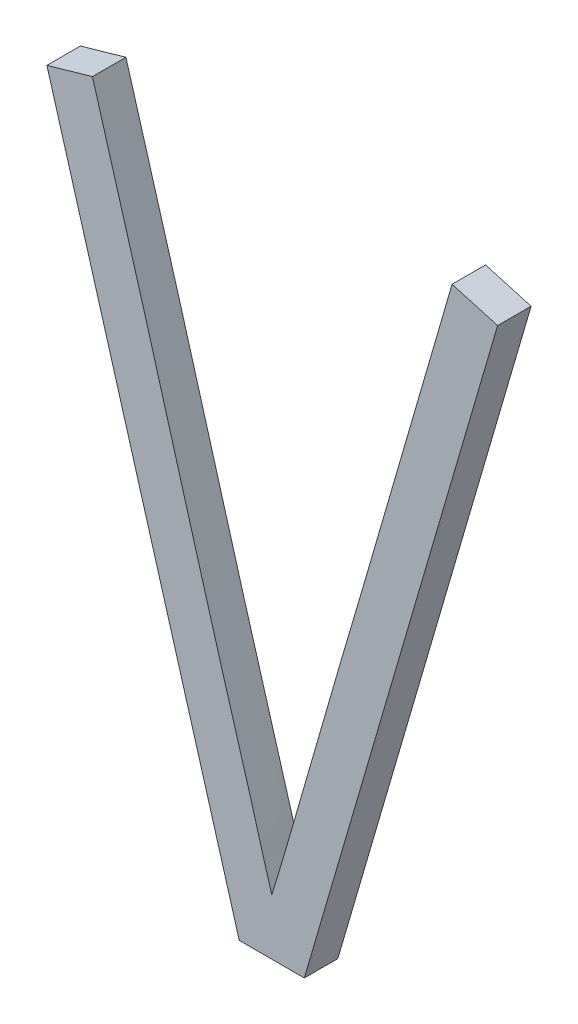
ISO-10303-21;
HEADER;
FILE_DESCRIPTION(('STEP AP214'),'2;1');
FILE_NAME('part.step','',(''),(''),'','','');
FILE_SCHEMA(('AUTOMOTIVE_DESIGN { 1 0 10303 214 1 1 1 1 }'));
ENDSEC;
DATA;
#1=APPLICATION_CONTEXT('core data for automotive mechanical design processes');
#2=APPLICATION_PROTOCOL_DEFINITION('international standard','automotive_design',2000,#1);
#3=PRODUCT_CONTEXT('',#1,'mechanical');
#4=PRODUCT('Part','Part','',(#3));
#5=PRODUCT_RELATED_PRODUCT_CATEGORY('part','',(#4));
#6=PRODUCT_DEFINITION_FORMATION('','',#4);
#7=PRODUCT_DEFINITION_CONTEXT('part definition',#1,'design');
#8=PRODUCT_DEFINITION('design','',#6,#7);
#9=PRODUCT_DEFINITION_SHAPE('','',#8);
#10=(LENGTH_UNIT() NAMED_UNIT(*) SI_UNIT(.MILLI.,.METRE.));
#11=(NAMED_UNIT(*) PLANE_ANGLE_UNIT() SI_UNIT($,.RADIAN.));
#12=(NAMED_UNIT(*) SI_UNIT($,.STERADIAN.) SOLID_ANGLE_UNIT());
#13=UNCERTAINTY_MEASURE_WITH_UNIT(LENGTH_MEASURE(1.E-05),#10,'distance_accuracy_value','');
#14=(GEOMETRIC_REPRESENTATION_CONTEXT(3) GLOBAL_UNCERTAINTY_ASSIGNED_CONTEXT((#13)) GLOBAL_UNIT_ASSIGNED_CONTEXT((#10,
#11,#12)) REPRESENTATION_CONTEXT('',''));
#15=CARTESIAN_POINT('',(0.,0.,0.));
#16=DIRECTION('',(0.,0.,1.));
#17=DIRECTION('',(1.,0.,0.));
#18=AXIS2_PLACEMENT_3D('',#15,#16,#17);
#19=CARTESIAN_POINT('',(148.165393177078,66.869071623967,-39.1));
#20=DIRECTION('',(0.,0.,1.));
#21=DIRECTION('',(1.,0.,0.));
#22=AXIS2_PLACEMENT_3D('',#19,#20,#21);
#23=PLANE('',#22);
#24=CARTESIAN_POINT('',(147.36008712506,67.7930468476711,-39.1));
#25=CARTESIAN_POINT('',(147.36950715995,67.761072172586,-39.1));
#26=CARTESIAN_POINT('',(147.378916668758,67.7290943956638,-39.1));
#27=CARTESIAN_POINT('',(147.397710961665,67.6651317332712,-39.1));
#28=CARTESIAN_POINT('',(147.407095745876,67.6331468478334,-39.1));
#29=CARTESIAN_POINT('',(147.435207865122,67.5371789367533,-39.1));
#30=CARTESIAN_POINT('',(147.453892729733,67.4731834602558,-39.1));
#31=CARTESIAN_POINT('',(147.491121981187,67.3451517856524,-39.1));
#32=CARTESIAN_POINT('',(147.509666368339,67.2811155876367,-39.1));
#33=CARTESIAN_POINT('',(147.546581864893,67.1529927307791,-39.1));
#34=CARTESIAN_POINT('',(147.564952972988,67.0889060715606,-39.1));
#35=CARTESIAN_POINT('',(147.592399605312,66.9927446724667,-39.1));
#36=CARTESIAN_POINT('',(147.601530151106,66.9606856142019,-39.1));
#37=CARTESIAN_POINT('',(147.619754626931,66.8965570683165,-39.1));
#38=CARTESIAN_POINT('',(147.628848556952,66.8644875806933,-39.1));
#39=CARTESIAN_POINT('',(147.659015193138,66.758406287851,-39.1));
#40=CARTESIAN_POINT('',(147.680191055627,66.6844239247388,-39.1));
#41=CARTESIAN_POINT('',(147.722781483505,66.5365268936578,-39.1));
#42=CARTESIAN_POINT('',(147.744196049204,66.4626122257771,-39.1));
#43=CARTESIAN_POINT('',(147.776885285108,66.3519075672974,-39.1));
#44=CARTESIAN_POINT('',(147.787876299194,66.3150337824738,-39.1));
#45=CARTESIAN_POINT('',(147.809814393848,66.2412729536008,-39.1));
#46=CARTESIAN_POINT('',(147.820761474547,66.2043859095913,-39.1));
#47=CARTESIAN_POINT('',(147.836872499413,66.1489652269203,-39.1));
#48=CARTESIAN_POINT('',(147.84219120302,66.1304767853057,-39.1));
#49=CARTESIAN_POINT('',(147.852731059657,66.0934719922423,-39.1));
#50=CARTESIAN_POINT('',(147.857952211651,66.0749556404994,-39.1));
#51=CARTESIAN_POINT('',(147.868368330914,66.0379148121562,-39.1));
#52=CARTESIAN_POINT('',(147.873563297038,66.0193903352382,-39.1));
#53=CARTESIAN_POINT('',(147.881512001052,65.9916474341452,-39.1));
#54=CARTESIAN_POINT('',(147.884187613388,65.9824070966032,-39.1));
#55=CARTESIAN_POINT('',(147.889686554057,65.9639697601432,-39.1));
#56=CARTESIAN_POINT('',(147.892509897015,65.9547727656149,-39.1));
#57=CARTESIAN_POINT('',(147.89545467013,65.9456127283911,-39.1));
#58=B_SPLINE_CURVE_WITH_KNOTS('',3,(#24,#25,#26,#27,#28,#29,#30,#31,#32,#33,#34,#35,#36,#37,#38,
#39,#40,#41,#42,#43,#44,#45,#46,#47,#48,#49,#50,#51,#52,#53,#54,#55,#56,#57),.UNSPECIFIED.,.F.,
.F.,(4,2,2,2,2,2,2,2,2,2,2,2,2,2,2,2,4),(0.,0.100000258752922,0.200000068886179,
0.400002203536709,0.600003896466351,0.800007096147163,0.9000088426627,1.00001061385149,
1.23087060455843,1.4617308950943,1.57716180940412,1.69259238034469,1.75030680186558,
1.80802183595669,1.86573937467342,1.89459818300726,1.92345985386881),.UNSPECIFIED.);
#59=CARTESIAN_POINT('',(147.360087125061,67.7930468476698,-39.1));
#60=VERTEX_POINT('',#59);
#61=CARTESIAN_POINT('',(147.89545467013,65.9456127283911,-39.1));
#62=VERTEX_POINT('',#61);
#63=EDGE_CURVE('E105',#60,#62,#58,.T.);
#64=ORIENTED_EDGE('',*,*,#63,.T.);
#65=CARTESIAN_POINT('',(147.89545467013,65.9456127283911,-39.1));
#66=CARTESIAN_POINT('',(147.898031632222,65.9535412531738,-39.1));
#67=CARTESIAN_POINT('',(147.900539160209,65.9614915705498,-39.1));
#68=CARTESIAN_POINT('',(147.90546738492,65.9774187894192,-39.1));
#69=CARTESIAN_POINT('',(147.907888085495,65.9853956897167,-39.1));
#70=CARTESIAN_POINT('',(147.915098226982,66.009341499801,-39.1));
#71=CARTESIAN_POINT('',(147.919835808545,66.0253258436347,-39.1));
#72=CARTESIAN_POINT('',(147.92928250306,66.0573026658751,-39.1));
#73=CARTESIAN_POINT('',(147.933991616436,66.0732951441568,-39.1));
#74=CARTESIAN_POINT('',(147.943376159649,66.1052901407925,-39.1));
#75=CARTESIAN_POINT('',(147.94805158918,66.1212926592364,-39.1));
#76=CARTESIAN_POINT('',(147.971377874188,66.2012996334036,-39.1));
#77=CARTESIAN_POINT('',(147.989892689447,66.2653436745062,-39.1));
#78=CARTESIAN_POINT('',(148.026871700727,66.3934458580657,-39.1));
#79=CARTESIAN_POINT('',(148.045335897017,66.457504000445,-39.1));
#80=CARTESIAN_POINT('',(148.073022500083,66.5535948814044,-39.1));
#81=CARTESIAN_POINT('',(148.082249860325,66.5856261606545,-39.1));
#82=CARTESIAN_POINT('',(148.100776795741,66.6496675874551,-39.1));
#83=CARTESIAN_POINT('',(148.110076370409,66.6816777351523,-39.1));
#84=CARTESIAN_POINT('',(148.128772604368,66.7456700198175,-39.1));
#85=CARTESIAN_POINT('',(148.138169264263,66.7776521566104,-39.1));
#86=CARTESIAN_POINT('',(148.157153724879,66.8415597349228,-39.1));
#87=CARTESIAN_POINT('',(148.166741526334,66.8734851762243,-39.1));
#88=CARTESIAN_POINT('',(148.187210694472,66.9423487258354,-39.1));
#89=CARTESIAN_POINT('',(148.198061883241,66.9792958180128,-39.1));
#90=CARTESIAN_POINT('',(148.219582328465,67.0532428165823,-39.1));
#91=CARTESIAN_POINT('',(148.230251584399,67.0902427231256,-39.1));
#92=CARTESIAN_POINT('',(148.251580488372,67.1642451972022,-39.1));
#93=CARTESIAN_POINT('',(148.26224013643,67.2012477647304,-39.1));
#94=CARTESIAN_POINT('',(148.283618572783,67.2752357572871,-39.1));
#95=CARTESIAN_POINT('',(148.294337360979,67.3122211823444,-39.1));
#96=CARTESIAN_POINT('',(148.32652498377,67.4231668972974,-39.1));
#97=CARTESIAN_POINT('',(148.348025471817,67.4971179951606,-39.1));
#98=CARTESIAN_POINT('',(148.390929167613,67.6450482063845,-39.1));
#99=CARTESIAN_POINT('',(148.41233237555,67.7190273196909,-39.1));
#100=CARTESIAN_POINT('',(148.43359614031,67.7930468476711,-39.1));
#101=B_SPLINE_CURVE_WITH_KNOTS('',3,(#65,#66,#67,#68,#69,#70,#71,#72,#73,#74,#75,#76,#77,#78,
#79,#80,#81,#82,#83,#84,#85,#86,#87,#88,#89,#90,#91,#92,#93,#94,#95,#96,#97,#98,#99,#100),
.UNSPECIFIED.,.F.,.F.,(4,2,2,2,2,2,2,2,2,2,2,2,2,2,2,2,2,4),(0.,0.0250090613853834,
0.0500170125768512,0.100031894549799,0.150046029711649,0.200060619703676,0.400060164416404,
0.600058635157055,0.700060207955259,0.800061078536629,0.900062569507321,1.00006444396406,
1.11558645965158,1.23110880665364,1.34663094168454,1.46215288172401,1.69319248941036,
1.9242316498274),.UNSPECIFIED.);
#102=CARTESIAN_POINT('',(148.43359614031,67.7930468476711,-39.1));
#103=VERTEX_POINT('',#102);
#104=EDGE_CURVE('E24',#62,#103,#101,.T.);
#105=ORIENTED_EDGE('',*,*,#104,.T.);
#106=DIRECTION('',(0.96152394764082,-0.274721127897389,0.));
#107=VECTOR('',#106,1.);
#108=CARTESIAN_POINT('',(148.569518470411,67.7542118962138,-39.1));
#109=LINE('',#108,#107);
#110=CARTESIAN_POINT('',(148.569518470411,67.7542118962129,-39.1));
#111=VERTEX_POINT('',#110);
#112=EDGE_CURVE('E63',#103,#111,#109,.T.);
#113=ORIENTED_EDGE('',*,*,#112,.T.);
#114=DIRECTION('',(-0.2804141240353,-0.959879116889994,0.));
#115=VECTOR('',#114,1.);
#116=CARTESIAN_POINT('',(147.992542048775,65.7791772221526,-39.1));
#117=LINE('',#116,#115);
#118=CARTESIAN_POINT('',(147.992542048775,65.7791772221512,-39.1));
#119=VERTEX_POINT('',#118);
#120=EDGE_CURVE('E71',#111,#119,#117,.T.);
#121=ORIENTED_EDGE('',*,*,#120,.T.);
#122=DIRECTION('',(1.,0.,0.));
#123=VECTOR('',#122,1.);
#124=CARTESIAN_POINT('',(147.79836729149,65.7791772221511,-39.1));
#125=LINE('',#124,#123);
#126=CARTESIAN_POINT('',(147.79836729149,65.7791772221511,-39.1));
#127=VERTEX_POINT('',#126);
#128=EDGE_CURVE('E180',#119,#127,#125,.F.);
#129=ORIENTED_EDGE('',*,*,#128,.T.);
#130=DIRECTION('',(-0.279171282963393,0.960241321110779,0.));
#131=VECTOR('',#130,1.);
#132=CARTESIAN_POINT('',(147.224164794959,67.7542118962107,-39.1));
#133=LINE('',#132,#131);
#134=CARTESIAN_POINT('',(147.224164794959,67.7542118962108,-39.1));
#135=VERTEX_POINT('',#134);
#136=EDGE_CURVE('E189',#127,#135,#133,.T.);
#137=ORIENTED_EDGE('',*,*,#136,.T.);
#138=DIRECTION('',(0.96152394764082,0.274721127897389,0.));
#139=VECTOR('',#138,1.);
#140=CARTESIAN_POINT('',(147.360087125061,67.7930468476685,-39.1));
#141=LINE('',#140,#139);
#142=EDGE_CURVE('E163',#135,#60,#141,.T.);
#143=ORIENTED_EDGE('',*,*,#142,.T.);
#144=EDGE_LOOP('',(#64,#105,#113,#121,#129,#137,#143));
#145=FACE_BOUND('',#144,.T.);
#146=ADVANCED_FACE('F17',(#145),#23,.F.);
#147=CARTESIAN_POINT('',(147.360087125061,67.7930468476685,-39.));
#148=DIRECTION('',(0.274721127897389,-0.96152394764082,0.));
#149=DIRECTION('',(0.96152394764082,0.274721127897389,0.));
#150=AXIS2_PLACEMENT_3D('',#147,#148,#149);
#151=PLANE('',#150);
#152=DIRECTION('',(0.,0.,1.));
#153=VECTOR('',#152,1.);
#154=CARTESIAN_POINT('',(147.224164794959,67.7542118962107,-39.));
#155=LINE('',#154,#153);
#156=CARTESIAN_POINT('',(147.22416479496,67.754211896211,-39.));
#157=VERTEX_POINT('',#156);
#158=EDGE_CURVE('E100',#135,#157,#155,.T.);
#159=ORIENTED_EDGE('',*,*,#158,.T.);
#160=DIRECTION('',(-0.961523947640779,-0.274721127897534,0.));
#161=VECTOR('',#160,1.);
#162=CARTESIAN_POINT('',(147.360087125061,67.7930468476685,-39.));
#163=LINE('',#162,#161);
#164=CARTESIAN_POINT('',(147.360087125061,67.7930468476698,-39.));
#165=VERTEX_POINT('',#164);
#166=EDGE_CURVE('E94',#165,#157,#163,.T.);
#167=ORIENTED_EDGE('',*,*,#166,.F.);
#168=DIRECTION('',(0.,0.,-1.));
#169=VECTOR('',#168,1.);
#170=CARTESIAN_POINT('',(147.36008712506,67.7930468476711,-39.05));
#171=LINE('',#170,#169);
#172=EDGE_CURVE('E97',#165,#60,#171,.T.);
#173=ORIENTED_EDGE('',*,*,#172,.T.);
#174=ORIENTED_EDGE('',*,*,#142,.F.);
#175=EDGE_LOOP('',(#159,#167,#173,#174));
#176=FACE_BOUND('',#175,.T.);
#177=ADVANCED_FACE('F96',(#176),#151,.F.);
#178=CARTESIAN_POINT('',(147.224164794959,67.7542118962107,-39.));
#179=DIRECTION('',(0.960241321110779,0.279171282963393,0.));
#180=DIRECTION('',(-0.279171282963393,0.960241321110779,0.));
#181=AXIS2_PLACEMENT_3D('',#178,#179,#180);
#182=PLANE('',#181);
#183=DIRECTION('',(0.,0.,1.));
#184=VECTOR('',#183,1.);
#185=CARTESIAN_POINT('',(147.79836729149,65.7791772221511,-39.));
#186=LINE('',#185,#184);
#187=CARTESIAN_POINT('',(147.79836729149,65.7791772221511,-39.));
#188=VERTEX_POINT('',#187);
#189=EDGE_CURVE('E187',#127,#188,#186,.T.);
#190=ORIENTED_EDGE('',*,*,#189,.T.);
#191=DIRECTION('',(0.279171282962724,-0.960241321110973,0.));
#192=VECTOR('',#191,1.);
#193=CARTESIAN_POINT('',(147.22416479496,67.7542118962111,-39.));
#194=LINE('',#193,#192);
#195=EDGE_CURVE('E104',#157,#188,#194,.T.);
#196=ORIENTED_EDGE('',*,*,#195,.F.);
#197=ORIENTED_EDGE('',*,*,#158,.F.);
#198=ORIENTED_EDGE('',*,*,#136,.F.);
#199=EDGE_LOOP('',(#190,#196,#197,#198));
#200=FACE_BOUND('',#199,.T.);
#201=ADVANCED_FACE('F149',(#200),#182,.F.);
#202=CARTESIAN_POINT('',(147.79836729149,65.7791772221511,-39.));
#203=DIRECTION('',(0.,1.,0.));
#204=DIRECTION('',(0.,0.,1.));
#205=AXIS2_PLACEMENT_3D('',#202,#203,#204);
#206=PLANE('',#205);
#207=DIRECTION('',(0.,0.,1.));
#208=VECTOR('',#207,1.);
#209=CARTESIAN_POINT('',(147.992542048775,65.7791772221512,-39.));
#210=LINE('',#209,#208);
#211=CARTESIAN_POINT('',(147.992542048775,65.7791772221511,-39.));
#212=VERTEX_POINT('',#211);
#213=EDGE_CURVE('E178',#119,#212,#210,.T.);
#214=ORIENTED_EDGE('',*,*,#213,.T.);
#215=DIRECTION('',(1.,0.,0.));
#216=VECTOR('',#215,1.);
#217=CARTESIAN_POINT('',(148.165393177078,65.7791772221511,-39.));
#218=LINE('',#217,#216);
#219=EDGE_CURVE('E175',#188,#212,#218,.T.);
#220=ORIENTED_EDGE('',*,*,#219,.F.);
#221=ORIENTED_EDGE('',*,*,#189,.F.);
#222=ORIENTED_EDGE('',*,*,#128,.F.);
#223=EDGE_LOOP('',(#214,#220,#221,#222));
#224=FACE_BOUND('',#223,.T.);
#225=ADVANCED_FACE('F146',(#224),#206,.F.);
#226=CARTESIAN_POINT('',(147.992542048775,65.7791772221526,-39.));
#227=DIRECTION('',(-0.959879116889994,0.2804141240353,0.));
#228=DIRECTION('',(-0.2804141240353,-0.959879116889994,0.));
#229=AXIS2_PLACEMENT_3D('',#226,#227,#228);
#230=PLANE('',#229);
#231=DIRECTION('',(0.,0.,1.));
#232=VECTOR('',#231,1.);
#233=CARTESIAN_POINT('',(148.569518470411,67.7542118962138,-39.));
#234=LINE('',#233,#232);
#235=CARTESIAN_POINT('',(148.569518470411,67.754211896212,-39.));
#236=VERTEX_POINT('',#235);
#237=EDGE_CURVE('E170',#111,#236,#234,.T.);
#238=ORIENTED_EDGE('',*,*,#237,.T.);
#239=DIRECTION('',(0.280414124035111,0.95987911689005,0.));
#240=VECTOR('',#239,1.);
#241=CARTESIAN_POINT('',(147.992542048775,65.7791772221511,-39.));
#242=LINE('',#241,#240);
#243=EDGE_CURVE('E116',#212,#236,#242,.T.);
#244=ORIENTED_EDGE('',*,*,#243,.F.);
#245=ORIENTED_EDGE('',*,*,#213,.F.);
#246=ORIENTED_EDGE('',*,*,#120,.F.);
#247=EDGE_LOOP('',(#238,#244,#245,#246));
#248=FACE_BOUND('',#247,.T.);
#249=ADVANCED_FACE('F143',(#248),#230,.F.);
#250=CARTESIAN_POINT('',(148.569518470411,67.7542118962138,-39.));
#251=DIRECTION('',(-0.274721127897389,-0.96152394764082,0.));
#252=DIRECTION('',(0.96152394764082,-0.274721127897389,0.));
#253=AXIS2_PLACEMENT_3D('',#250,#251,#252);
#254=PLANE('',#253);
#255=DIRECTION('',(0.,0.,1.));
#256=VECTOR('',#255,1.);
#257=CARTESIAN_POINT('',(148.43359614031,67.7930468476711,-39.05));
#258=LINE('',#257,#256);
#259=CARTESIAN_POINT('',(148.43359614031,67.7930468476711,-39.));
#260=VERTEX_POINT('',#259);
#261=EDGE_CURVE('E165',#103,#260,#258,.T.);
#262=ORIENTED_EDGE('',*,*,#261,.T.);
#263=DIRECTION('',(-0.9615239476355,0.27472112791601,0.));
#264=VECTOR('',#263,1.);
#265=CARTESIAN_POINT('',(148.56951847041,67.7542118962111,-39.));
#266=LINE('',#265,#264);
#267=EDGE_CURVE('E114',#236,#260,#266,.T.);
#268=ORIENTED_EDGE('',*,*,#267,.F.);
#269=ORIENTED_EDGE('',*,*,#237,.F.);
#270=ORIENTED_EDGE('',*,*,#112,.F.);
#271=EDGE_LOOP('',(#262,#268,#269,#270));
#272=FACE_BOUND('',#271,.T.);
#273=ADVANCED_FACE('F139',(#272),#254,.F.);
#274=CARTESIAN_POINT('',(148.43359614031,67.7930468476711,-39.));
#275=CARTESIAN_POINT('',(148.43359614031,67.7930468476711,-39.1));
#276=CARTESIAN_POINT('',(148.4038930415,67.6896355089511,-39.));
#277=CARTESIAN_POINT('',(148.4038930415,67.6896355089511,-39.1));
#278=CARTESIAN_POINT('',(148.34583061401,67.4895370524111,-39.));
#279=CARTESIAN_POINT('',(148.34583061401,67.4895370524111,-39.1));
#280=CARTESIAN_POINT('',(148.26147591395,67.1992621120111,-39.));
#281=CARTESIAN_POINT('',(148.26147591395,67.1992621120111,-39.1));
#282=CARTESIAN_POINT('',(148.19727113691,66.9750912561411,-39.));
#283=CARTESIAN_POINT('',(148.19727113691,66.9750912561411,-39.1));
#284=CARTESIAN_POINT('',(148.14814364913,66.8116656650511,-39.));
#285=CARTESIAN_POINT('',(148.14814364913,66.8116656650511,-39.1));
#286=CARTESIAN_POINT('',(148.11583739353,66.7016157657711,-39.));
#287=CARTESIAN_POINT('',(148.11583739353,66.7016157657711,-39.1));
#288=CARTESIAN_POINT('',(148.08439177939,66.5931478737911,-39.));
#289=CARTESIAN_POINT('',(148.08439177939,66.5931478737911,-39.1));
#290=CARTESIAN_POINT('',(148.05420244207,66.4882182213711,-39.));
#291=CARTESIAN_POINT('',(148.05420244207,66.4882182213711,-39.1));
#292=CARTESIAN_POINT('',(148.02552481961,66.3888231947411,-39.));
#293=CARTESIAN_POINT('',(148.02552481961,66.3888231947411,-39.1));
#294=CARTESIAN_POINT('',(147.99883983501,66.2962998994112,-39.));
#295=CARTESIAN_POINT('',(147.99883983501,66.2962998994112,-39.1));
#296=CARTESIAN_POINT('',(147.97431535255,66.2114809751311,-39.));
#297=CARTESIAN_POINT('',(147.97431535255,66.2114809751311,-39.1));
#298=CARTESIAN_POINT('',(147.95212542838,66.1351975695711,-39.));
#299=CARTESIAN_POINT('',(147.95212542838,66.1351975695711,-39.1));
#300=CARTESIAN_POINT('',(147.93273583628,66.0689230239111,-39.));
#301=CARTESIAN_POINT('',(147.93273583628,66.0689230239111,-39.1));
#302=CARTESIAN_POINT('',(147.91673024826,66.0148251990111,-39.));
#303=CARTESIAN_POINT('',(147.91673024826,66.0148251990111,-39.1));
#304=CARTESIAN_POINT('',(147.90480884988,65.9750334008911,-39.));
#305=CARTESIAN_POINT('',(147.90480884988,65.9750334008911,-39.1));
#306=CARTESIAN_POINT('',(147.89808324439,65.9537103197911,-39.));
#307=CARTESIAN_POINT('',(147.89808324439,65.9537103197911,-39.1));
#308=CARTESIAN_POINT('',(147.89545467013,65.9456127283911,-39.));
#309=CARTESIAN_POINT('',(147.89545467013,65.9456127283911,-39.1));
#310=B_SPLINE_SURFACE_WITH_KNOTS('',3,1,((#274,#275),(#276,#277),(#278,#279),(#280,#281),(#282,
#283),(#284,#285),(#286,#287),(#288,#289),(#290,#291),(#292,#293),(#294,#295),(#296,#297),(#298,
#299),(#300,#301),(#302,#303),(#304,#305),(#306,#307),(#308,#309)),.UNSPECIFIED.,.F.,.F.,.F.,(4,
1,1,1,1,1,1,1,1,1,1,1,1,1,1,4),(2,2),(0.,0.1677421935607,0.32483576468,0.4712807587735,
0.531283389647,0.5908879033489,0.6500950895056,0.7073547788952,0.7611162009851,0.8113793571536,
0.8574842677003,0.8987710140583,0.93523970682659,0.96514144411123,0.98672767738162,1.),(1.,1.1),.UNSPECIFIED.);
#311=DIRECTION('',(0.,0.,1.));
#312=VECTOR('',#311,1.);
#313=CARTESIAN_POINT('',(147.89545467013,65.9456127283911,-39.05));
#314=LINE('',#313,#312);
#315=CARTESIAN_POINT('',(147.89545467013,65.9456127283911,-39.));
#316=VERTEX_POINT('',#315);
#317=EDGE_CURVE('E44',#62,#316,#314,.T.);
#318=CARTESIAN_POINT('',(148.43359614031,67.7930468476711,-39.));
#319=CARTESIAN_POINT('',(148.424393964571,67.7610088230179,-39.));
#320=CARTESIAN_POINT('',(148.415164629245,67.7289786209528,-39.));
#321=CARTESIAN_POINT('',(148.396667567213,67.6649293199262,-39.));
#322=CARTESIAN_POINT('',(148.387399840529,67.6329102209584,-39.));
#323=CARTESIAN_POINT('',(148.359562948743,67.5368627088916,-39.));
#324=CARTESIAN_POINT('',(148.340960072815,67.4728440837701,-39.));
#325=CARTESIAN_POINT('',(148.303779289452,67.3447995838746,-39.));
#326=CARTESIAN_POINT('',(148.285201382,67.2807737091057,-39.));
#327=CARTESIAN_POINT('',(148.257467227065,67.1846962176775,-39.));
#328=CARTESIAN_POINT('',(148.248244581283,67.1526637825132,-39.));
#329=CARTESIAN_POINT('',(148.229778050124,67.0886052998505,-39.));
#330=CARTESIAN_POINT('',(148.220534164896,67.0565792523093,-39.));
#331=CARTESIAN_POINT('',(148.201936240943,66.9925588198722,-39.));
#332=CARTESIAN_POINT('',(148.192582201932,66.9605644350589,-39.));
#333=CARTESIAN_POINT('',(148.173647660422,66.8966426037005,-39.));
#334=CARTESIAN_POINT('',(148.164067156235,66.8647151576563,-39.));
#335=CARTESIAN_POINT('',(148.143565026042,66.7958594885809,-39.));
#336=CARTESIAN_POINT('',(148.132666129212,66.7589244992705,-39.));
#337=CARTESIAN_POINT('',(148.11103055445,66.6850072194182,-39.));
#338=CARTESIAN_POINT('',(148.100293876096,66.6480249289997,-39.));
#339=CARTESIAN_POINT('',(148.07890487242,66.5740361379494,-39.));
#340=CARTESIAN_POINT('',(148.068252546898,66.5370296373755,-39.));
#341=CARTESIAN_POINT('',(148.046927623873,66.4630223606264,-39.));
#342=CARTESIAN_POINT('',(148.036255026312,66.426021584468,-39.));
#343=CARTESIAN_POINT('',(148.014911886828,66.3520193388708,-39.));
#344=CARTESIAN_POINT('',(148.004241344909,66.3150178694305,-39.));
#345=CARTESIAN_POINT('',(147.982857932453,66.241027360322,-39.));
#346=CARTESIAN_POINT('',(147.972145062153,66.2040383205851,-39.));
#347=CARTESIAN_POINT('',(147.956010529875,66.1485734861006,-39.));
#348=CARTESIAN_POINT('',(147.950621447533,66.1300882136878,-39.));
#349=CARTESIAN_POINT('',(147.939812073912,66.0931269192408,-39.));
#350=CARTESIAN_POINT('',(147.934391782864,66.074650897139,-39.));
#351=CARTESIAN_POINT('',(147.923507162709,66.0377113707886,-39.));
#352=CARTESIAN_POINT('',(147.918042832471,66.0192478668745,-39.));
#353=CARTESIAN_POINT('',(147.909755349545,65.9915791797539,-39.));
#354=CARTESIAN_POINT('',(147.906977656137,65.982360599671,-39.));
#355=CARTESIAN_POINT('',(147.901315403613,65.9639560743527,-39.));
#356=CARTESIAN_POINT('',(147.898430840201,65.954770130445,-39.));
#357=CARTESIAN_POINT('',(147.89545467013,65.9456127283911,-39.));
#358=B_SPLINE_CURVE_WITH_KNOTS('',3,(#318,#319,#320,#321,#322,#323,#324,#325,#326,#327,#328,
#329,#330,#331,#332,#333,#334,#335,#336,#337,#338,#339,#340,#341,#342,#343,#344,#345,#346,#347,
#348,#349,#350,#351,#352,#353,#354,#355,#356,#357),.UNSPECIFIED.,.F.,.F.,(4,2,2,2,2,2,2,2,2,2,2,
2,2,2,2,2,2,2,2,4),(0.,0.100000138213088,0.200000220674667,0.400000395404615,0.600000430920207,
0.700001435486516,0.800001744795815,0.900002314279683,1.00000362944108,1.11553159561296,
1.23105926100341,1.34658665066559,1.46211437447288,1.57764239706483,1.69316977002787,
1.75093417625746,1.80869815457101,1.86646362065275,1.89534705969222,1.92423166053322),.UNSPECIFIED.);
#359=EDGE_CURVE('E35',#260,#316,#358,.T.);
#360=ORIENTED_EDGE('',*,*,#317,.T.);
#361=ORIENTED_EDGE('',*,*,#359,.F.);
#362=ORIENTED_EDGE('',*,*,#261,.F.);
#363=ORIENTED_EDGE('',*,*,#104,.F.);
#364=EDGE_LOOP('',(#360,#361,#362,#363));
#365=FACE_BOUND('',#364,.T.);
#366=ADVANCED_FACE('F132',(#365),#310,.F.);
#367=CARTESIAN_POINT('',(147.89545467013,65.9456127283911,-39.));
#368=CARTESIAN_POINT('',(147.89545467013,65.9456127283911,-39.1));
#369=CARTESIAN_POINT('',(147.89285637025,65.9537043860611,-39.));
#370=CARTESIAN_POINT('',(147.89285637025,65.9537043860611,-39.1));
#371=CARTESIAN_POINT('',(147.886277019,65.9750111674711,-39.));
#372=CARTESIAN_POINT('',(147.886277019,65.9750111674711,-39.1));
#373=CARTESIAN_POINT('',(147.87484559006,66.0148120197811,-39.));
#374=CARTESIAN_POINT('',(147.87484559006,66.0148120197811,-39.1));
#375=CARTESIAN_POINT('',(147.85965769384,66.0689658967111,-39.));
#376=CARTESIAN_POINT('',(147.85965769384,66.0689658967111,-39.1));
#377=CARTESIAN_POINT('',(147.84089840136,66.1352887670811,-39.));
#378=CARTESIAN_POINT('',(147.84089840136,66.1352887670811,-39.1));
#379=CARTESIAN_POINT('',(147.81866722516,66.2115618406011,-39.));
#380=CARTESIAN_POINT('',(147.81866722516,66.2115618406011,-39.1));
#381=CARTESIAN_POINT('',(147.7934413267,66.2963103936311,-39.));
#382=CARTESIAN_POINT('',(147.7934413267,66.2963103936311,-39.1));
#383=CARTESIAN_POINT('',(147.76592097754,66.3887692349011,-39.));
#384=CARTESIAN_POINT('',(147.76592097754,66.3887692349011,-39.1));
#385=CARTESIAN_POINT('',(147.73682596132,66.4881780886111,-39.));
#386=CARTESIAN_POINT('',(147.73682596132,66.4881780886111,-39.1));
#387=CARTESIAN_POINT('',(147.70645385933,66.5930850082811,-39.));
#388=CARTESIAN_POINT('',(147.70645385933,66.5930850082811,-39.1));
#389=CARTESIAN_POINT('',(147.67531515553,66.7015372558611,-39.));
#390=CARTESIAN_POINT('',(147.67531515553,66.7015372558611,-39.1));
#391=CARTESIAN_POINT('',(147.64385709966,66.8115639925111,-39.));
#392=CARTESIAN_POINT('',(147.64385709966,66.8115639925111,-39.1));
#393=CARTESIAN_POINT('',(147.59740492883,66.9754119052911,-39.));
#394=CARTESIAN_POINT('',(147.59740492883,66.9754119052911,-39.1));
#395=CARTESIAN_POINT('',(147.53341682312,67.1993723866311,-39.));
#396=CARTESIAN_POINT('',(147.53341682312,67.1993723866311,-39.1));
#397=CARTESIAN_POINT('',(147.4492249163,67.4896973459611,-39.));
#398=CARTESIAN_POINT('',(147.4492249163,67.4896973459611,-39.1));
#399=CARTESIAN_POINT('',(147.3905250343,67.6897309587111,-39.));
#400=CARTESIAN_POINT('',(147.3905250343,67.6897309587111,-39.1));
#401=CARTESIAN_POINT('',(147.36008712506,67.7930468476711,-39.));
#402=CARTESIAN_POINT('',(147.36008712506,67.7930468476711,-39.1));
#403=B_SPLINE_SURFACE_WITH_KNOTS('',3,1,((#367,#368),(#369,#370),(#371,#372),(#373,#374),(#375,
#376),(#377,#378),(#379,#380),(#381,#382),(#383,#384),(#385,#386),(#387,#388),(#389,#390),(#391,
#392),(#393,#394),(#395,#396),(#397,#398),(#399,#400),(#401,#402)),.UNSPECIFIED.,.F.,.F.,.F.,(4,
1,1,1,1,1,1,1,1,1,1,1,1,1,1,4),(2,2),(0.,0.0132536897874,0.0347802475098,0.06458271335,
0.1009772378863,0.142280532942,0.1884940199295,0.2388898566501,0.2927399217966,0.350044802038,
0.4092312693372,0.4687258190242,0.5285285813908,0.6748548007006,0.8320113386128,1.),(1.,1.1),.UNSPECIFIED.);
#404=CARTESIAN_POINT('',(147.89545467013,65.9456127283911,-39.));
#405=CARTESIAN_POINT('',(147.892902803686,65.9535504499199,-39.));
#406=CARTESIAN_POINT('',(147.890442637608,65.9615163774902,-39.));
#407=CARTESIAN_POINT('',(147.885641888592,65.9774834586338,-39.));
#408=CARTESIAN_POINT('',(147.88330129327,65.9854846084658,-39.));
#409=CARTESIAN_POINT('',(147.876362328628,66.0095118525036,-39.));
#410=CARTESIAN_POINT('',(147.871846856519,66.0255614914472,-39.));
#411=CARTESIAN_POINT('',(147.858302802972,66.0736995140708,-39.));
#412=CARTESIAN_POINT('',(147.849273541334,66.1057878210868,-39.));
#413=CARTESIAN_POINT('',(147.830858782129,66.1698623049445,-39.));
#414=CARTESIAN_POINT('',(147.821473284404,66.2018484817412,-39.));
#415=CARTESIAN_POINT('',(147.802550913886,66.2657748681244,-39.));
#416=CARTESIAN_POINT('',(147.793014043436,66.297715078414,-39.));
#417=CARTESIAN_POINT('',(147.774020035911,66.3616191385516,-39.));
#418=CARTESIAN_POINT('',(147.76456289829,66.3935829882361,-39.));
#419=CARTESIAN_POINT('',(147.74578366115,66.4575503838807,-39.));
#420=CARTESIAN_POINT('',(147.736461561959,66.4895539299366,-39.));
#421=CARTESIAN_POINT('',(147.717893225563,66.5535831545142,-39.));
#422=CARTESIAN_POINT('',(147.708646988788,66.5856088331605,-39.));
#423=CARTESIAN_POINT('',(147.685318600589,66.6666259300344,-39.));
#424=CARTESIAN_POINT('',(147.671266895269,66.7156261291956,-39.));
#425=CARTESIAN_POINT('',(147.643296783121,66.813664435685,-39.));
#426=CARTESIAN_POINT('',(147.629378376118,66.8627025429631,-39.));
#427=CARTESIAN_POINT('',(147.601501955768,66.9607682931197,-39.));
#428=CARTESIAN_POINT('',(147.587543941827,67.0097959358294,-39.));
#429=CARTESIAN_POINT('',(147.559528497888,67.1078227987586,-39.));
#430=CARTESIAN_POINT('',(147.545471067963,67.156822018999,-39.));
#431=CARTESIAN_POINT('',(147.50315011979,67.3037756212196,-39.));
#432=CARTESIAN_POINT('',(147.474737621884,67.4016870774889,-39.));
#433=CARTESIAN_POINT('',(147.417612698561,67.5974246647251,-39.));
#434=CARTESIAN_POINT('',(147.388900267076,67.6952507939221,-39.));
#435=CARTESIAN_POINT('',(147.36008712506,67.7930468476711,-39.));
#436=B_SPLINE_CURVE_WITH_KNOTS('',3,(#404,#405,#406,#407,#408,#409,#410,#411,#412,#413,#414,
#415,#416,#417,#418,#419,#420,#421,#422,#423,#424,#425,#426,#427,#428,#429,#430,#431,#432,#433,
#434,#435),.UNSPECIFIED.,.F.,.F.,(4,2,2,2,2,2,2,2,2,2,2,2,2,2,2,4),(0.,0.0250112623888965,
0.050019929251233,0.100038046076776,0.200040567408797,0.300043132930335,0.400044152199,
0.500044486217347,0.600045062093238,0.700046205104019,0.852971571168381,1.00589673559315,
1.15882420346918,1.31175155826116,1.61760273548357,1.92346011275618),.UNSPECIFIED.);
#437=EDGE_CURVE('E11',#316,#165,#436,.T.);
#438=ORIENTED_EDGE('',*,*,#172,.F.);
#439=ORIENTED_EDGE('',*,*,#437,.F.);
#440=ORIENTED_EDGE('',*,*,#317,.F.);
#441=ORIENTED_EDGE('',*,*,#63,.F.);
#442=EDGE_LOOP('',(#438,#439,#440,#441));
#443=FACE_BOUND('',#442,.T.);
#444=ADVANCED_FACE('F19',(#443),#403,.F.);
#445=CARTESIAN_POINT('',(148.165393177078,66.869071623967,-39.));
#446=DIRECTION('',(0.,0.,1.));
#447=DIRECTION('',(1.,0.,0.));
#448=AXIS2_PLACEMENT_3D('',#445,#446,#447);
#449=PLANE('',#448);
#450=ORIENTED_EDGE('',*,*,#359,.T.);
#451=ORIENTED_EDGE('',*,*,#437,.T.);
#452=ORIENTED_EDGE('',*,*,#166,.T.);
#453=ORIENTED_EDGE('',*,*,#195,.T.);
#454=ORIENTED_EDGE('',*,*,#219,.T.);
#455=ORIENTED_EDGE('',*,*,#243,.T.);
#456=ORIENTED_EDGE('',*,*,#267,.T.);
#457=EDGE_LOOP('',(#450,#451,#452,#453,#454,#455,#456));
#458=FACE_BOUND('',#457,.T.);
#459=ADVANCED_FACE('F110',(#458),#449,.T.);
#460=CLOSED_SHELL('',(#146,#177,#201,#225,#249,#273,#366,#444,#459));
#461=MANIFOLD_SOLID_BREP('B1',#460);
#462=ADVANCED_BREP_SHAPE_REPRESENTATION('',(#18,#461),#14);
#463=SHAPE_DEFINITION_REPRESENTATION(#9,#462);
ENDSEC;
END-ISO-10303-21;
